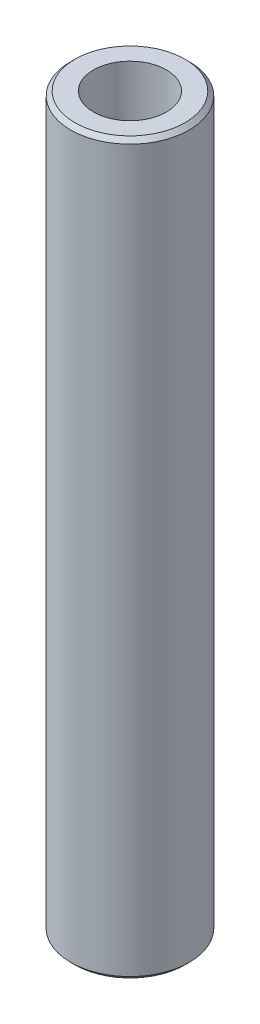
ISO-10303-21;
HEADER;
FILE_DESCRIPTION(('STEP AP214'),'2;1');
FILE_NAME('part.step','',(''),(''),'','','');
FILE_SCHEMA(('AUTOMOTIVE_DESIGN { 1 0 10303 214 1 1 1 1 }'));
ENDSEC;
DATA;
#1=APPLICATION_CONTEXT('core data for automotive mechanical design processes');
#2=APPLICATION_PROTOCOL_DEFINITION('international standard','automotive_design',2000,#1);
#3=PRODUCT_CONTEXT('',#1,'mechanical');
#4=PRODUCT('Part','Part','',(#3));
#5=PRODUCT_RELATED_PRODUCT_CATEGORY('part','',(#4));
#6=PRODUCT_DEFINITION_FORMATION('','',#4);
#7=PRODUCT_DEFINITION_CONTEXT('part definition',#1,'design');
#8=PRODUCT_DEFINITION('design','',#6,#7);
#9=PRODUCT_DEFINITION_SHAPE('','',#8);
#10=(LENGTH_UNIT() NAMED_UNIT(*) SI_UNIT(.MILLI.,.METRE.));
#11=(NAMED_UNIT(*) PLANE_ANGLE_UNIT() SI_UNIT($,.RADIAN.));
#12=(NAMED_UNIT(*) SI_UNIT($,.STERADIAN.) SOLID_ANGLE_UNIT());
#13=UNCERTAINTY_MEASURE_WITH_UNIT(LENGTH_MEASURE(1.E-05),#10,'distance_accuracy_value','');
#14=(GEOMETRIC_REPRESENTATION_CONTEXT(3) GLOBAL_UNCERTAINTY_ASSIGNED_CONTEXT((#13)) GLOBAL_UNIT_ASSIGNED_CONTEXT((#10,
#11,#12)) REPRESENTATION_CONTEXT('',''));
#15=CARTESIAN_POINT('',(0.,0.,0.));
#16=DIRECTION('',(0.,0.,1.));
#17=DIRECTION('',(1.,0.,0.));
#18=AXIS2_PLACEMENT_3D('',#15,#16,#17);
#19=CARTESIAN_POINT('',(0.,430.609199673994,0.));
#20=DIRECTION('',(0.,-1.,0.));
#21=DIRECTION('',(0.,0.,-1.));
#22=AXIS2_PLACEMENT_3D('',#19,#20,#21);
#23=CYLINDRICAL_SURFACE('',#22,35.);
#24=CARTESIAN_POINT('',(0.,428.119461317987,0.));
#25=DIRECTION('',(0.,1.,0.));
#26=DIRECTION('',(0.,0.,1.));
#27=AXIS2_PLACEMENT_3D('',#24,#25,#26);
#28=CIRCLE('',#27,35.);
#29=CARTESIAN_POINT('',(0.,428.119461317987,35.));
#30=VERTEX_POINT('',#29);
#31=EDGE_CURVE('E50',#30,#30,#28,.F.);
#32=ORIENTED_EDGE('',*,*,#31,.T.);
#33=EDGE_LOOP('',(#32));
#34=FACE_BOUND('',#33,.T.);
#35=CARTESIAN_POINT('',(0.,2.4897383560068,0.));
#36=DIRECTION('',(0.,1.,0.));
#37=DIRECTION('',(0.,0.,1.));
#38=AXIS2_PLACEMENT_3D('',#35,#36,#37);
#39=CIRCLE('',#38,35.);
#40=CARTESIAN_POINT('',(0.,2.4897383560068,35.));
#41=VERTEX_POINT('',#40);
#42=EDGE_CURVE('E51',#41,#41,#39,.T.);
#43=ORIENTED_EDGE('',*,*,#42,.T.);
#44=EDGE_LOOP('',(#43));
#45=FACE_BOUND('',#44,.T.);
#46=ADVANCED_FACE('F39',(#34,#45),#23,.T.);
#47=CARTESIAN_POINT('',(0.,430.609199673994,0.));
#48=DIRECTION('',(0.,1.,0.));
#49=DIRECTION('',(0.,0.,1.));
#50=AXIS2_PLACEMENT_3D('',#47,#48,#49);
#51=PLANE('',#50);
#52=CARTESIAN_POINT('',(0.,430.609199673994,0.));
#53=DIRECTION('',(0.,1.,0.));
#54=DIRECTION('',(0.,0.,1.));
#55=AXIS2_PLACEMENT_3D('',#52,#53,#54);
#56=CIRCLE('',#55,32.5102616439932);
#57=CARTESIAN_POINT('',(0.,430.609199673994,32.5102616439932));
#58=VERTEX_POINT('',#57);
#59=EDGE_CURVE('E54',#58,#58,#56,.T.);
#60=ORIENTED_EDGE('',*,*,#59,.T.);
#61=EDGE_LOOP('',(#60));
#62=FACE_BOUND('',#61,.T.);
#63=CARTESIAN_POINT('',(0.,430.609199673994,0.));
#64=DIRECTION('',(0.,1.,0.));
#65=DIRECTION('',(0.,0.,1.));
#66=AXIS2_PLACEMENT_3D('',#63,#64,#65);
#67=CIRCLE('',#66,21.5471412663726);
#68=CARTESIAN_POINT('',(0.,430.609199673994,21.5471412663726));
#69=VERTEX_POINT('',#68);
#70=EDGE_CURVE('E58',#69,#69,#67,.T.);
#71=ORIENTED_EDGE('',*,*,#70,.F.);
#72=EDGE_LOOP('',(#71));
#73=FACE_BOUND('',#72,.T.);
#74=ADVANCED_FACE('F69',(#62,#73),#51,.T.);
#75=CARTESIAN_POINT('',(0.,0.,0.));
#76=DIRECTION('',(0.,1.,0.));
#77=DIRECTION('',(0.,0.,1.));
#78=AXIS2_PLACEMENT_3D('',#75,#76,#77);
#79=PLANE('',#78);
#80=CARTESIAN_POINT('',(0.,0.,0.));
#81=DIRECTION('',(0.,1.,0.));
#82=DIRECTION('',(0.,0.,1.));
#83=AXIS2_PLACEMENT_3D('',#80,#81,#82);
#84=CIRCLE('',#83,32.5102616439932);
#85=CARTESIAN_POINT('',(0.,0.,32.5102616439932));
#86=VERTEX_POINT('',#85);
#87=EDGE_CURVE('E10',#86,#86,#84,.F.);
#88=ORIENTED_EDGE('',*,*,#87,.T.);
#89=EDGE_LOOP('',(#88));
#90=FACE_BOUND('',#89,.T.);
#91=CARTESIAN_POINT('',(0.,0.,0.));
#92=DIRECTION('',(0.,1.,0.));
#93=DIRECTION('',(0.,0.,1.));
#94=AXIS2_PLACEMENT_3D('',#91,#92,#93);
#95=CIRCLE('',#94,21.5471412663726);
#96=CARTESIAN_POINT('',(0.,0.,21.5471412663726));
#97=VERTEX_POINT('',#96);
#98=EDGE_CURVE('E63',#97,#97,#95,.T.);
#99=ORIENTED_EDGE('',*,*,#98,.T.);
#100=EDGE_LOOP('',(#99));
#101=FACE_BOUND('',#100,.T.);
#102=ADVANCED_FACE('F75',(#90,#101),#79,.F.);
#103=CARTESIAN_POINT('',(0.,430.609199673994,0.));
#104=DIRECTION('',(0.,-1.,0.));
#105=DIRECTION('',(0.,0.,-1.));
#106=AXIS2_PLACEMENT_3D('',#103,#104,#105);
#107=CYLINDRICAL_SURFACE('',#106,21.5471412663726);
#108=ORIENTED_EDGE('',*,*,#70,.T.);
#109=EDGE_LOOP('',(#108));
#110=FACE_BOUND('',#109,.T.);
#111=ORIENTED_EDGE('',*,*,#98,.F.);
#112=EDGE_LOOP('',(#111));
#113=FACE_BOUND('',#112,.T.);
#114=ADVANCED_FACE('F70',(#110,#113),#107,.F.);
#115=CARTESIAN_POINT('',(0.,430.609199673994,0.));
#116=DIRECTION('',(0.,-1.,0.));
#117=DIRECTION('',(0.,0.,-1.));
#118=AXIS2_PLACEMENT_3D('',#115,#116,#117);
#119=CONICAL_SURFACE('',#118,32.5102616439932,0.785398163397455);
#120=ORIENTED_EDGE('',*,*,#31,.F.);
#121=EDGE_LOOP('',(#120));
#122=FACE_BOUND('',#121,.T.);
#123=ORIENTED_EDGE('',*,*,#59,.F.);
#124=EDGE_LOOP('',(#123));
#125=FACE_BOUND('',#124,.T.);
#126=ADVANCED_FACE('F81',(#122,#125),#119,.T.);
#127=CARTESIAN_POINT('',(0.,2.4897383560068,0.));
#128=DIRECTION('',(0.,1.,0.));
#129=DIRECTION('',(0.,0.,1.));
#130=AXIS2_PLACEMENT_3D('',#127,#128,#129);
#131=CONICAL_SURFACE('',#130,35.,0.785398163397444);
#132=CARTESIAN_POINT('',(0.,0.,32.5102616439932));
#133=CARTESIAN_POINT('',(0.,0.025934774541737,32.536196418535));
#134=CARTESIAN_POINT('',(0.,0.0518695490834745,32.5621311930767));
#135=CARTESIAN_POINT('',(0.,0.10373909816695,32.6140007421602));
#136=CARTESIAN_POINT('',(0.,0.129673872708687,32.6399355167019));
#137=CARTESIAN_POINT('',(0.,0.181543421792162,32.6918050657854));
#138=CARTESIAN_POINT('',(0.,0.207478196333899,32.7177398403271));
#139=CARTESIAN_POINT('',(0.,0.259347745417375,32.7696093894106));
#140=CARTESIAN_POINT('',(0.,0.285282519959113,32.7955441639523));
#141=CARTESIAN_POINT('',(0.,0.337152069042587,32.8474137130358));
#142=CARTESIAN_POINT('',(0.,0.363086843584324,32.8733484875776));
#143=CARTESIAN_POINT('',(0.,0.414956392667799,32.925218036661));
#144=CARTESIAN_POINT('',(0.,0.440891167209537,32.9511528112028));
#145=CARTESIAN_POINT('',(0.,0.492760716293012,33.0030223602862));
#146=CARTESIAN_POINT('',(0.,0.518695490834749,33.028957134828));
#147=CARTESIAN_POINT('',(0.,0.570565039918224,33.0808266839114));
#148=CARTESIAN_POINT('',(0.,0.596499814459962,33.1067614584532));
#149=CARTESIAN_POINT('',(0.,0.648369363543436,33.1586310075367));
#150=CARTESIAN_POINT('',(0.,0.674304138085174,33.1845657820784));
#151=CARTESIAN_POINT('',(0.,0.726173687168649,33.2364353311619));
#152=CARTESIAN_POINT('',(0.,0.752108461710387,33.2623701057036));
#153=CARTESIAN_POINT('',(0.,0.803978010793862,33.3142396547871));
#154=CARTESIAN_POINT('',(0.,0.829912785335598,33.3401744293288));
#155=CARTESIAN_POINT('',(0.,0.881782334419073,33.3920439784123));
#156=CARTESIAN_POINT('',(0.,0.907717108960811,33.417978752954));
#157=CARTESIAN_POINT('',(0.,0.959586658044287,33.4698483020375));
#158=CARTESIAN_POINT('',(0.,0.985521432586024,33.4957830765793));
#159=CARTESIAN_POINT('',(0.,1.0373909816695,33.5476526256627));
#160=CARTESIAN_POINT('',(0.,1.06332575621124,33.5735874002045));
#161=CARTESIAN_POINT('',(0.,1.11519530529471,33.6254569492879));
#162=CARTESIAN_POINT('',(0.,1.14113007983645,33.6513917238297));
#163=CARTESIAN_POINT('',(0.,1.19299962891992,33.7032612729131));
#164=CARTESIAN_POINT('',(0.,1.21893440346166,33.7291960474549));
#165=CARTESIAN_POINT('',(0.,1.27080395254514,33.7810655965384));
#166=CARTESIAN_POINT('',(0.,1.29673872708687,33.8070003710801));
#167=CARTESIAN_POINT('',(0.,1.34860827617035,33.8588699201636));
#168=CARTESIAN_POINT('',(0.,1.37454305071209,33.8848046947053));
#169=CARTESIAN_POINT('',(0.,1.42641259979556,33.9366742437888));
#170=CARTESIAN_POINT('',(0.,1.4523473743373,33.9626090183305));
#171=CARTESIAN_POINT('',(0.,1.50421692342077,34.014478567414));
#172=CARTESIAN_POINT('',(0.,1.53015169796251,34.0404133419557));
#173=CARTESIAN_POINT('',(0.,1.58202124704599,34.0922828910392));
#174=CARTESIAN_POINT('',(0.,1.60795602158772,34.1182176655809));
#175=CARTESIAN_POINT('',(0.,1.6598255706712,34.1700872146644));
#176=CARTESIAN_POINT('',(0.,1.68576034521294,34.1960219892062));
#177=CARTESIAN_POINT('',(0.,1.73762989429641,34.2478915382896));
#178=CARTESIAN_POINT('',(0.,1.76356466883815,34.2738263128314));
#179=CARTESIAN_POINT('',(0.,1.81543421792162,34.3256958619148));
#180=CARTESIAN_POINT('',(0.,1.84136899246336,34.3516306364566));
#181=CARTESIAN_POINT('',(0.,1.89323854154684,34.4035001855401));
#182=CARTESIAN_POINT('',(0.,1.91917331608857,34.4294349600818));
#183=CARTESIAN_POINT('',(0.,1.97104286517205,34.4813045091653));
#184=CARTESIAN_POINT('',(0.,1.99697763971379,34.507239283707));
#185=CARTESIAN_POINT('',(0.,2.04884718879726,34.5591088327905));
#186=CARTESIAN_POINT('',(0.,2.074781963339,34.5850436073322));
#187=CARTESIAN_POINT('',(0.,2.12665151242247,34.6369131564157));
#188=CARTESIAN_POINT('',(0.,2.15258628696421,34.6628479309574));
#189=CARTESIAN_POINT('',(0.,2.20445583604769,34.7147174800409));
#190=CARTESIAN_POINT('',(0.,2.23039061058942,34.7406522545826));
#191=CARTESIAN_POINT('',(0.,2.2822601596729,34.7925218036661));
#192=CARTESIAN_POINT('',(0.,2.30819493421464,34.8184565782079));
#193=CARTESIAN_POINT('',(0.,2.36006448329811,34.8703261272913));
#194=CARTESIAN_POINT('',(0.,2.38599925783985,34.8962609018331));
#195=CARTESIAN_POINT('',(0.,2.43786880692332,34.9481304509165));
#196=CARTESIAN_POINT('',(0.,2.46380358146506,34.9740652254583));
#197=CARTESIAN_POINT('',(0.,2.4897383560068,35.));
#198=B_SPLINE_CURVE_WITH_KNOTS('',3,(#132,#133,#134,#135,#136,#137,#138,#139,#140,#141,#142,
#143,#144,#145,#146,#147,#148,#149,#150,#151,#152,#153,#154,#155,#156,#157,#158,#159,#160,#161,
#162,#163,#164,#165,#166,#167,#168,#169,#170,#171,#172,#173,#174,#175,#176,#177,#178,#179,#180,
#181,#182,#183,#184,#185,#186,#187,#188,#189,#190,#191,#192,#193,#194,#195,#196,#197),
.UNSPECIFIED.,.F.,.F.,(4,2,2,2,2,2,2,2,2,2,2,2,2,2,2,2,2,2,2,2,2,2,2,2,2,2,2,2,2,2,2,2,4),(0.,
0.11003192968204,0.220063859364079,0.330095789046119,0.440127718728159,0.550159648410203,
0.660191578092243,0.770223507774282,0.880255437456322,0.990287367138362,1.1003192968204,
1.21035122650245,1.32038315618449,1.43041508586653,1.54044701554857,1.6504789452306,
1.76051087491264,1.87054280459469,1.98057473427673,2.09060666395877,2.20063859364081,
2.31067052332285,2.42070245300489,2.53073438268693,2.64076631236897,2.75079824205101,
2.86083017173305,2.97086210141509,3.08089403109713,3.19092596077917,3.30095789046121,
3.41098982014325,3.52102174982529),.UNSPECIFIED.);
#199=EDGE_CURVE('BSEAM45',#86,#41,#198,.T.);
#200=ORIENTED_EDGE('',*,*,#87,.F.);
#201=ORIENTED_EDGE('',*,*,#42,.F.);
#202=ORIENTED_EDGE('',*,*,#199,.T.);
#203=ORIENTED_EDGE('',*,*,#199,.F.);
#204=EDGE_LOOP('',(#200,#202,#201,#203));
#205=FACE_BOUND('',#204,.T.);
#206=ADVANCED_FACE('F45',(#205),#131,.T.);
#207=CLOSED_SHELL('',(#46,#74,#102,#114,#126,#206));
#208=MANIFOLD_SOLID_BREP('B2',#207);
#209=ADVANCED_BREP_SHAPE_REPRESENTATION('',(#18,#208),#14);
#210=SHAPE_DEFINITION_REPRESENTATION(#9,#209);
ENDSEC;
END-ISO-10303-21;
